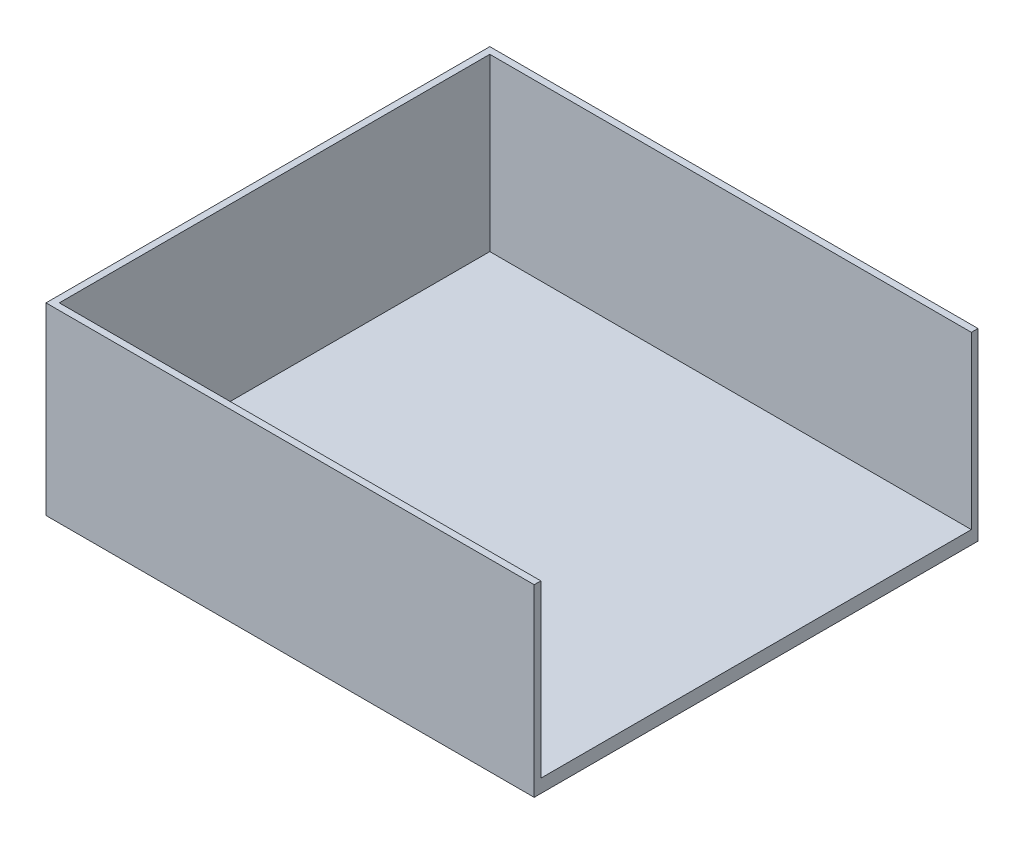
ISO-10303-21;
HEADER;
FILE_DESCRIPTION(('STEP AP214'),'2;1');
FILE_NAME('part.step','',(''),(''),'','','');
FILE_SCHEMA(('AUTOMOTIVE_DESIGN { 1 0 10303 214 1 1 1 1 }'));
ENDSEC;
DATA;
#1=APPLICATION_CONTEXT('core data for automotive mechanical design processes');
#2=APPLICATION_PROTOCOL_DEFINITION('international standard','automotive_design',2000,#1);
#3=PRODUCT_CONTEXT('',#1,'mechanical');
#4=PRODUCT('Part','Part','',(#3));
#5=PRODUCT_RELATED_PRODUCT_CATEGORY('part','',(#4));
#6=PRODUCT_DEFINITION_FORMATION('','',#4);
#7=PRODUCT_DEFINITION_CONTEXT('part definition',#1,'design');
#8=PRODUCT_DEFINITION('design','',#6,#7);
#9=PRODUCT_DEFINITION_SHAPE('','',#8);
#10=(LENGTH_UNIT() NAMED_UNIT(*) SI_UNIT(.MILLI.,.METRE.));
#11=(NAMED_UNIT(*) PLANE_ANGLE_UNIT() SI_UNIT($,.RADIAN.));
#12=(NAMED_UNIT(*) SI_UNIT($,.STERADIAN.) SOLID_ANGLE_UNIT());
#13=UNCERTAINTY_MEASURE_WITH_UNIT(LENGTH_MEASURE(1.E-05),#10,'distance_accuracy_value','');
#14=(GEOMETRIC_REPRESENTATION_CONTEXT(3) GLOBAL_UNCERTAINTY_ASSIGNED_CONTEXT((#13)) GLOBAL_UNIT_ASSIGNED_CONTEXT((#10,
#11,#12)) REPRESENTATION_CONTEXT('',''));
#15=CARTESIAN_POINT('',(0.,0.,0.));
#16=DIRECTION('',(0.,0.,1.));
#17=DIRECTION('',(1.,0.,0.));
#18=AXIS2_PLACEMENT_3D('',#15,#16,#17);
#19=CARTESIAN_POINT('',(-107.506152746939,3.,112.54245699338));
#20=DIRECTION('',(-1.,0.,0.));
#21=DIRECTION('',(0.,0.,1.));
#22=AXIS2_PLACEMENT_3D('',#19,#20,#21);
#23=PLANE('',#22);
#24=DIRECTION('',(0.,0.,-1.));
#25=VECTOR('',#24,1.);
#26=CARTESIAN_POINT('',(-107.506152746939,0.,112.54245699338));
#27=LINE('',#26,#25);
#28=CARTESIAN_POINT('',(-107.506152746939,0.,112.54245699338));
#29=VERTEX_POINT('',#28);
#30=CARTESIAN_POINT('',(-107.506152746939,0.,-87.4575430066202));
#31=VERTEX_POINT('',#30);
#32=EDGE_CURVE('E150',#29,#31,#27,.T.);
#33=ORIENTED_EDGE('',*,*,#32,.F.);
#34=DIRECTION('',(0.,-1.,0.));
#35=VECTOR('',#34,1.);
#36=CARTESIAN_POINT('',(-107.506152746939,3.,112.54245699338));
#37=LINE('',#36,#35);
#38=CARTESIAN_POINT('',(-107.506152746939,83.,112.54245699338));
#39=VERTEX_POINT('',#38);
#40=EDGE_CURVE('E11',#39,#29,#37,.T.);
#41=ORIENTED_EDGE('',*,*,#40,.F.);
#42=DIRECTION('',(0.,0.,-1.));
#43=VECTOR('',#42,1.);
#44=CARTESIAN_POINT('',(-107.506152746939,83.,112.54245699338));
#45=LINE('',#44,#43);
#46=CARTESIAN_POINT('',(-107.506152746939,83.,-87.4575430066202));
#47=VERTEX_POINT('',#46);
#48=EDGE_CURVE('E138',#39,#47,#45,.T.);
#49=ORIENTED_EDGE('',*,*,#48,.T.);
#50=DIRECTION('',(0.,-1.,0.));
#51=VECTOR('',#50,1.);
#52=CARTESIAN_POINT('',(-107.506152746939,3.,-87.4575430066202));
#53=LINE('',#52,#51);
#54=EDGE_CURVE('E41',#47,#31,#53,.T.);
#55=ORIENTED_EDGE('',*,*,#54,.T.);
#56=EDGE_LOOP('',(#33,#41,#49,#55));
#57=FACE_BOUND('',#56,.T.);
#58=ADVANCED_FACE('F38',(#57),#23,.T.);
#59=CARTESIAN_POINT('',(-107.506152746939,3.,112.54245699338));
#60=DIRECTION('',(0.,0.,-1.));
#61=DIRECTION('',(-1.,0.,0.));
#62=AXIS2_PLACEMENT_3D('',#59,#60,#61);
#63=PLANE('',#62);
#64=DIRECTION('',(1.,0.,0.));
#65=VECTOR('',#64,1.);
#66=CARTESIAN_POINT('',(-107.506152746939,0.,112.54245699338));
#67=LINE('',#66,#65);
#68=CARTESIAN_POINT('',(112.493847253061,0.,112.54245699338));
#69=VERTEX_POINT('',#68);
#70=EDGE_CURVE('E159',#29,#69,#67,.T.);
#71=ORIENTED_EDGE('',*,*,#70,.T.);
#72=DIRECTION('',(0.,-1.,0.));
#73=VECTOR('',#72,1.);
#74=CARTESIAN_POINT('',(112.493847253061,3.,112.54245699338));
#75=LINE('',#74,#73);
#76=CARTESIAN_POINT('',(112.493847253061,83.,112.54245699338));
#77=VERTEX_POINT('',#76);
#78=EDGE_CURVE('E46',#77,#69,#75,.T.);
#79=ORIENTED_EDGE('',*,*,#78,.F.);
#80=DIRECTION('',(-1.,0.,0.));
#81=VECTOR('',#80,1.);
#82=CARTESIAN_POINT('',(112.493847253061,83.,112.54245699338));
#83=LINE('',#82,#81);
#84=EDGE_CURVE('E148',#77,#39,#83,.T.);
#85=ORIENTED_EDGE('',*,*,#84,.T.);
#86=ORIENTED_EDGE('',*,*,#40,.T.);
#87=EDGE_LOOP('',(#71,#79,#85,#86));
#88=FACE_BOUND('',#87,.T.);
#89=ADVANCED_FACE('F173',(#88),#63,.F.);
#90=CARTESIAN_POINT('',(112.493847253061,3.,112.54245699338));
#91=DIRECTION('',(-1.,0.,0.));
#92=DIRECTION('',(0.,0.,1.));
#93=AXIS2_PLACEMENT_3D('',#90,#91,#92);
#94=PLANE('',#93);
#95=DIRECTION('',(0.,0.,-1.));
#96=VECTOR('',#95,1.);
#97=CARTESIAN_POINT('',(112.493847253061,83.,112.54245699338));
#98=LINE('',#97,#96);
#99=CARTESIAN_POINT('',(112.493847253061,83.,-84.4575430066202));
#100=VERTEX_POINT('',#99);
#101=CARTESIAN_POINT('',(112.493847253061,83.,-87.4575430066202));
#102=VERTEX_POINT('',#101);
#103=EDGE_CURVE('E125',#100,#102,#98,.T.);
#104=ORIENTED_EDGE('',*,*,#103,.F.);
#105=DIRECTION('',(0.,-1.,0.));
#106=VECTOR('',#105,1.);
#107=CARTESIAN_POINT('',(112.493847253061,3.,-84.4575430066203));
#108=LINE('',#107,#106);
#109=CARTESIAN_POINT('',(112.493847253061,6.00000000000001,-84.4575430066202));
#110=VERTEX_POINT('',#109);
#111=EDGE_CURVE('E104',#100,#110,#108,.T.);
#112=ORIENTED_EDGE('',*,*,#111,.T.);
#113=DIRECTION('',(0.,0.,1.));
#114=VECTOR('',#113,1.);
#115=CARTESIAN_POINT('',(112.493847253061,6.00000000000001,112.54245699338));
#116=LINE('',#115,#114);
#117=CARTESIAN_POINT('',(112.493847253061,6.00000000000001,109.54245699338));
#118=VERTEX_POINT('',#117);
#119=EDGE_CURVE('E114',#110,#118,#116,.T.);
#120=ORIENTED_EDGE('',*,*,#119,.T.);
#121=DIRECTION('',(0.,1.,0.));
#122=VECTOR('',#121,1.);
#123=CARTESIAN_POINT('',(112.493847253061,3.,109.54245699338));
#124=LINE('',#123,#122);
#125=CARTESIAN_POINT('',(112.493847253061,83.,109.54245699338));
#126=VERTEX_POINT('',#125);
#127=EDGE_CURVE('E121',#118,#126,#124,.T.);
#128=ORIENTED_EDGE('',*,*,#127,.T.);
#129=EDGE_CURVE('E145',#77,#126,#98,.T.);
#130=ORIENTED_EDGE('',*,*,#129,.F.);
#131=ORIENTED_EDGE('',*,*,#78,.T.);
#132=DIRECTION('',(0.,0.,-1.));
#133=VECTOR('',#132,1.);
#134=CARTESIAN_POINT('',(112.493847253061,0.,112.54245699338));
#135=LINE('',#134,#133);
#136=CARTESIAN_POINT('',(112.493847253061,0.,-87.4575430066202));
#137=VERTEX_POINT('',#136);
#138=EDGE_CURVE('E156',#69,#137,#135,.T.);
#139=ORIENTED_EDGE('',*,*,#138,.T.);
#140=DIRECTION('',(0.,-1.,0.));
#141=VECTOR('',#140,1.);
#142=CARTESIAN_POINT('',(112.493847253061,3.,-87.4575430066202));
#143=LINE('',#142,#141);
#144=EDGE_CURVE('E162',#102,#137,#143,.T.);
#145=ORIENTED_EDGE('',*,*,#144,.F.);
#146=EDGE_LOOP('',(#104,#112,#120,#128,#130,#131,#139,#145));
#147=FACE_BOUND('',#146,.T.);
#148=ADVANCED_FACE('F123',(#147),#94,.F.);
#149=CARTESIAN_POINT('',(-107.506152746939,3.,-87.4575430066202));
#150=DIRECTION('',(0.,0.,-1.));
#151=DIRECTION('',(-1.,0.,0.));
#152=AXIS2_PLACEMENT_3D('',#149,#150,#151);
#153=PLANE('',#152);
#154=DIRECTION('',(1.,0.,0.));
#155=VECTOR('',#154,1.);
#156=CARTESIAN_POINT('',(-107.506152746939,0.,-87.4575430066202));
#157=LINE('',#156,#155);
#158=EDGE_CURVE('E153',#31,#137,#157,.T.);
#159=ORIENTED_EDGE('',*,*,#158,.F.);
#160=ORIENTED_EDGE('',*,*,#54,.F.);
#161=DIRECTION('',(1.,0.,0.));
#162=VECTOR('',#161,1.);
#163=CARTESIAN_POINT('',(-107.506152746939,83.,-87.4575430066202));
#164=LINE('',#163,#162);
#165=EDGE_CURVE('E142',#47,#102,#164,.T.);
#166=ORIENTED_EDGE('',*,*,#165,.T.);
#167=ORIENTED_EDGE('',*,*,#144,.T.);
#168=EDGE_LOOP('',(#159,#160,#166,#167));
#169=FACE_BOUND('',#168,.T.);
#170=ADVANCED_FACE('F169',(#169),#153,.T.);
#171=CARTESIAN_POINT('',(0.,0.,0.));
#172=DIRECTION('',(0.,-1.,0.));
#173=DIRECTION('',(0.,0.,-1.));
#174=AXIS2_PLACEMENT_3D('',#171,#172,#173);
#175=PLANE('',#174);
#176=ORIENTED_EDGE('',*,*,#32,.T.);
#177=ORIENTED_EDGE('',*,*,#158,.T.);
#178=ORIENTED_EDGE('',*,*,#138,.F.);
#179=ORIENTED_EDGE('',*,*,#70,.F.);
#180=EDGE_LOOP('',(#176,#177,#178,#179));
#181=FACE_BOUND('',#180,.T.);
#182=ADVANCED_FACE('F172',(#181),#175,.T.);
#183=CARTESIAN_POINT('',(0.,83.,0.));
#184=DIRECTION('',(0.,-1.,0.));
#185=DIRECTION('',(0.,0.,-1.));
#186=AXIS2_PLACEMENT_3D('',#183,#184,#185);
#187=PLANE('',#186);
#188=DIRECTION('',(-1.,0.,0.));
#189=VECTOR('',#188,1.);
#190=CARTESIAN_POINT('',(109.493847253061,83.,-84.4575430066202));
#191=LINE('',#190,#189);
#192=CARTESIAN_POINT('',(-104.506152746939,83.,-84.4575430066202));
#193=VERTEX_POINT('',#192);
#194=EDGE_CURVE('E54',#100,#193,#191,.T.);
#195=ORIENTED_EDGE('',*,*,#194,.F.);
#196=ORIENTED_EDGE('',*,*,#103,.T.);
#197=ORIENTED_EDGE('',*,*,#165,.F.);
#198=ORIENTED_EDGE('',*,*,#48,.F.);
#199=ORIENTED_EDGE('',*,*,#84,.F.);
#200=ORIENTED_EDGE('',*,*,#129,.T.);
#201=DIRECTION('',(1.,0.,0.));
#202=VECTOR('',#201,1.);
#203=CARTESIAN_POINT('',(-104.506152746939,83.,109.54245699338));
#204=LINE('',#203,#202);
#205=CARTESIAN_POINT('',(-104.506152746939,83.,109.54245699338));
#206=VERTEX_POINT('',#205);
#207=EDGE_CURVE('E111',#206,#126,#204,.T.);
#208=ORIENTED_EDGE('',*,*,#207,.F.);
#209=DIRECTION('',(0.,0.,1.));
#210=VECTOR('',#209,1.);
#211=CARTESIAN_POINT('',(-104.506152746939,83.,-84.4575430066202));
#212=LINE('',#211,#210);
#213=EDGE_CURVE('E127',#193,#206,#212,.T.);
#214=ORIENTED_EDGE('',*,*,#213,.F.);
#215=EDGE_LOOP('',(#195,#196,#197,#198,#199,#200,#208,#214));
#216=FACE_BOUND('',#215,.T.);
#217=ADVANCED_FACE('F178',(#216),#187,.F.);
#218=CARTESIAN_POINT('',(109.493847253061,6.00000000000001,-84.4575430066202));
#219=DIRECTION('',(0.,0.,-1.));
#220=DIRECTION('',(-1.,0.,0.));
#221=AXIS2_PLACEMENT_3D('',#218,#219,#220);
#222=PLANE('',#221);
#223=ORIENTED_EDGE('',*,*,#194,.T.);
#224=DIRECTION('',(0.,1.,0.));
#225=VECTOR('',#224,1.);
#226=CARTESIAN_POINT('',(-104.506152746939,6.00000000000001,-84.4575430066202));
#227=LINE('',#226,#225);
#228=CARTESIAN_POINT('',(-104.506152746939,6.00000000000001,-84.4575430066202));
#229=VERTEX_POINT('',#228);
#230=EDGE_CURVE('E106',#229,#193,#227,.T.);
#231=ORIENTED_EDGE('',*,*,#230,.F.);
#232=DIRECTION('',(-1.,0.,0.));
#233=VECTOR('',#232,1.);
#234=CARTESIAN_POINT('',(109.493847253061,6.00000000000001,-84.4575430066202));
#235=LINE('',#234,#233);
#236=EDGE_CURVE('E100',#110,#229,#235,.T.);
#237=ORIENTED_EDGE('',*,*,#236,.F.);
#238=ORIENTED_EDGE('',*,*,#111,.F.);
#239=EDGE_LOOP('',(#223,#231,#237,#238));
#240=FACE_BOUND('',#239,.T.);
#241=ADVANCED_FACE('F102',(#240),#222,.F.);
#242=CARTESIAN_POINT('',(-104.506152746939,6.00000000000001,109.54245699338));
#243=DIRECTION('',(0.,0.,1.));
#244=DIRECTION('',(1.,0.,0.));
#245=AXIS2_PLACEMENT_3D('',#242,#243,#244);
#246=PLANE('',#245);
#247=ORIENTED_EDGE('',*,*,#207,.T.);
#248=ORIENTED_EDGE('',*,*,#127,.F.);
#249=DIRECTION('',(1.,0.,0.));
#250=VECTOR('',#249,1.);
#251=CARTESIAN_POINT('',(-104.506152746939,6.00000000000001,109.54245699338));
#252=LINE('',#251,#250);
#253=CARTESIAN_POINT('',(-104.506152746939,6.00000000000001,109.54245699338));
#254=VERTEX_POINT('',#253);
#255=EDGE_CURVE('E117',#254,#118,#252,.T.);
#256=ORIENTED_EDGE('',*,*,#255,.F.);
#257=DIRECTION('',(0.,1.,0.));
#258=VECTOR('',#257,1.);
#259=CARTESIAN_POINT('',(-104.506152746939,6.00000000000001,109.54245699338));
#260=LINE('',#259,#258);
#261=EDGE_CURVE('E136',#254,#206,#260,.T.);
#262=ORIENTED_EDGE('',*,*,#261,.T.);
#263=EDGE_LOOP('',(#247,#248,#256,#262));
#264=FACE_BOUND('',#263,.T.);
#265=ADVANCED_FACE('F183',(#264),#246,.F.);
#266=CARTESIAN_POINT('',(-104.506152746939,6.00000000000001,-84.4575430066202));
#267=DIRECTION('',(-1.,0.,0.));
#268=DIRECTION('',(0.,0.,1.));
#269=AXIS2_PLACEMENT_3D('',#266,#267,#268);
#270=PLANE('',#269);
#271=ORIENTED_EDGE('',*,*,#213,.T.);
#272=ORIENTED_EDGE('',*,*,#261,.F.);
#273=DIRECTION('',(0.,0.,1.));
#274=VECTOR('',#273,1.);
#275=CARTESIAN_POINT('',(-104.506152746939,6.00000000000001,-84.4575430066202));
#276=LINE('',#275,#274);
#277=EDGE_CURVE('E110',#229,#254,#276,.T.);
#278=ORIENTED_EDGE('',*,*,#277,.F.);
#279=ORIENTED_EDGE('',*,*,#230,.T.);
#280=EDGE_LOOP('',(#271,#272,#278,#279));
#281=FACE_BOUND('',#280,.T.);
#282=ADVANCED_FACE('F181',(#281),#270,.F.);
#283=CARTESIAN_POINT('',(0.,6.00000000000001,0.));
#284=DIRECTION('',(0.,1.,0.));
#285=DIRECTION('',(0.,0.,1.));
#286=AXIS2_PLACEMENT_3D('',#283,#284,#285);
#287=PLANE('',#286);
#288=ORIENTED_EDGE('',*,*,#236,.T.);
#289=ORIENTED_EDGE('',*,*,#277,.T.);
#290=ORIENTED_EDGE('',*,*,#255,.T.);
#291=ORIENTED_EDGE('',*,*,#119,.F.);
#292=EDGE_LOOP('',(#288,#289,#290,#291));
#293=FACE_BOUND('',#292,.T.);
#294=ADVANCED_FACE('F115',(#293),#287,.T.);
#295=CLOSED_SHELL('',(#58,#89,#148,#170,#182,#217,#241,#265,#282,#294));
#296=MANIFOLD_SOLID_BREP('B2',#295);
#297=ADVANCED_BREP_SHAPE_REPRESENTATION('',(#18,#296),#14);
#298=SHAPE_DEFINITION_REPRESENTATION(#9,#297);
ENDSEC;
END-ISO-10303-21;
